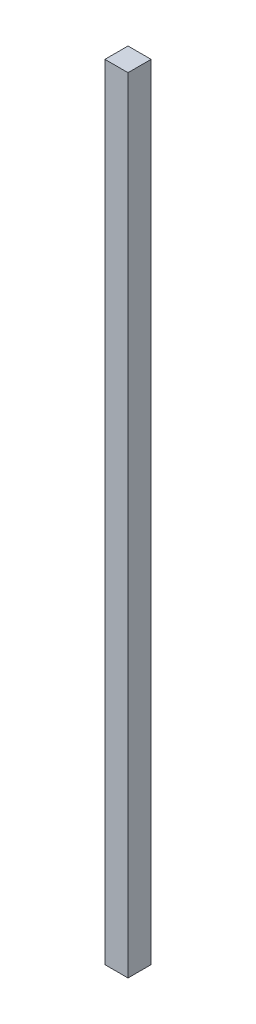
ISO-10303-21;
HEADER;
FILE_DESCRIPTION(('STEP AP214'),'2;1');
FILE_NAME('part.step','',(''),(''),'','','');
FILE_SCHEMA(('AUTOMOTIVE_DESIGN { 1 0 10303 214 1 1 1 1 }'));
ENDSEC;
DATA;
#1=APPLICATION_CONTEXT('core data for automotive mechanical design processes');
#2=APPLICATION_PROTOCOL_DEFINITION('international standard','automotive_design',2000,#1);
#3=PRODUCT_CONTEXT('',#1,'mechanical');
#4=PRODUCT('Part','Part','',(#3));
#5=PRODUCT_RELATED_PRODUCT_CATEGORY('part','',(#4));
#6=PRODUCT_DEFINITION_FORMATION('','',#4);
#7=PRODUCT_DEFINITION_CONTEXT('part definition',#1,'design');
#8=PRODUCT_DEFINITION('design','',#6,#7);
#9=PRODUCT_DEFINITION_SHAPE('','',#8);
#10=(LENGTH_UNIT() NAMED_UNIT(*) SI_UNIT(.MILLI.,.METRE.));
#11=(NAMED_UNIT(*) PLANE_ANGLE_UNIT() SI_UNIT($,.RADIAN.));
#12=(NAMED_UNIT(*) SI_UNIT($,.STERADIAN.) SOLID_ANGLE_UNIT());
#13=UNCERTAINTY_MEASURE_WITH_UNIT(LENGTH_MEASURE(1.E-05),#10,'distance_accuracy_value','');
#14=(GEOMETRIC_REPRESENTATION_CONTEXT(3) GLOBAL_UNCERTAINTY_ASSIGNED_CONTEXT((#13)) GLOBAL_UNIT_ASSIGNED_CONTEXT((#10,
#11,#12)) REPRESENTATION_CONTEXT('',''));
#15=CARTESIAN_POINT('',(0.,0.,0.));
#16=DIRECTION('',(0.,0.,1.));
#17=DIRECTION('',(1.,0.,0.));
#18=AXIS2_PLACEMENT_3D('',#15,#16,#17);
#19=CARTESIAN_POINT('',(0.,647.,0.));
#20=DIRECTION('',(1.,0.,0.));
#21=DIRECTION('',(0.,0.,-1.));
#22=AXIS2_PLACEMENT_3D('',#19,#20,#21);
#23=PLANE('',#22);
#24=DIRECTION('',(0.,0.,1.));
#25=VECTOR('',#24,1.);
#26=CARTESIAN_POINT('',(0.,0.,0.));
#27=LINE('',#26,#25);
#28=CARTESIAN_POINT('',(0.,0.,0.));
#29=VERTEX_POINT('',#28);
#30=CARTESIAN_POINT('',(0.,0.,19.05));
#31=VERTEX_POINT('',#30);
#32=EDGE_CURVE('E96',#29,#31,#27,.T.);
#33=ORIENTED_EDGE('',*,*,#32,.T.);
#34=DIRECTION('',(0.,-1.,0.));
#35=VECTOR('',#34,1.);
#36=CARTESIAN_POINT('',(0.,647.,19.05));
#37=LINE('',#36,#35);
#38=CARTESIAN_POINT('',(0.,647.,19.05));
#39=VERTEX_POINT('',#38);
#40=EDGE_CURVE('E11',#39,#31,#37,.T.);
#41=ORIENTED_EDGE('',*,*,#40,.F.);
#42=DIRECTION('',(0.,0.,1.));
#43=VECTOR('',#42,1.);
#44=CARTESIAN_POINT('',(0.,647.,0.));
#45=LINE('',#44,#43);
#46=CARTESIAN_POINT('',(0.,647.,0.));
#47=VERTEX_POINT('',#46);
#48=EDGE_CURVE('E84',#47,#39,#45,.T.);
#49=ORIENTED_EDGE('',*,*,#48,.F.);
#50=DIRECTION('',(0.,-1.,0.));
#51=VECTOR('',#50,1.);
#52=CARTESIAN_POINT('',(0.,647.,0.));
#53=LINE('',#52,#51);
#54=EDGE_CURVE('E92',#47,#29,#53,.T.);
#55=ORIENTED_EDGE('',*,*,#54,.T.);
#56=EDGE_LOOP('',(#33,#41,#49,#55));
#57=FACE_BOUND('',#56,.T.);
#58=ADVANCED_FACE('F33',(#57),#23,.F.);
#59=CARTESIAN_POINT('',(0.,647.,19.05));
#60=DIRECTION('',(0.,0.,-1.));
#61=DIRECTION('',(-1.,0.,0.));
#62=AXIS2_PLACEMENT_3D('',#59,#60,#61);
#63=PLANE('',#62);
#64=DIRECTION('',(1.,0.,0.));
#65=VECTOR('',#64,1.);
#66=CARTESIAN_POINT('',(0.,0.,19.05));
#67=LINE('',#66,#65);
#68=CARTESIAN_POINT('',(19.05,0.,19.05));
#69=VERTEX_POINT('',#68);
#70=EDGE_CURVE('E88',#31,#69,#67,.T.);
#71=ORIENTED_EDGE('',*,*,#70,.T.);
#72=DIRECTION('',(0.,-1.,0.));
#73=VECTOR('',#72,1.);
#74=CARTESIAN_POINT('',(19.05,647.,19.05));
#75=LINE('',#74,#73);
#76=CARTESIAN_POINT('',(19.05,647.,19.05));
#77=VERTEX_POINT('',#76);
#78=EDGE_CURVE('E41',#77,#69,#75,.T.);
#79=ORIENTED_EDGE('',*,*,#78,.F.);
#80=DIRECTION('',(1.,0.,0.));
#81=VECTOR('',#80,1.);
#82=CARTESIAN_POINT('',(0.,647.,19.05));
#83=LINE('',#82,#81);
#84=EDGE_CURVE('E79',#39,#77,#83,.T.);
#85=ORIENTED_EDGE('',*,*,#84,.F.);
#86=ORIENTED_EDGE('',*,*,#40,.T.);
#87=EDGE_LOOP('',(#71,#79,#85,#86));
#88=FACE_BOUND('',#87,.T.);
#89=ADVANCED_FACE('F87',(#88),#63,.F.);
#90=CARTESIAN_POINT('',(19.05,647.,0.));
#91=DIRECTION('',(-1.,0.,0.));
#92=DIRECTION('',(0.,0.,1.));
#93=AXIS2_PLACEMENT_3D('',#90,#91,#92);
#94=PLANE('',#93);
#95=DIRECTION('',(0.,0.,-1.));
#96=VECTOR('',#95,1.);
#97=CARTESIAN_POINT('',(19.05,0.,0.));
#98=LINE('',#97,#96);
#99=CARTESIAN_POINT('',(19.05,0.,0.));
#100=VERTEX_POINT('',#99);
#101=EDGE_CURVE('E66',#69,#100,#98,.T.);
#102=ORIENTED_EDGE('',*,*,#101,.T.);
#103=DIRECTION('',(0.,-1.,0.));
#104=VECTOR('',#103,1.);
#105=CARTESIAN_POINT('',(19.05,647.,0.));
#106=LINE('',#105,#104);
#107=CARTESIAN_POINT('',(19.05,647.,0.));
#108=VERTEX_POINT('',#107);
#109=EDGE_CURVE('E89',#108,#100,#106,.T.);
#110=ORIENTED_EDGE('',*,*,#109,.F.);
#111=DIRECTION('',(0.,0.,-1.));
#112=VECTOR('',#111,1.);
#113=CARTESIAN_POINT('',(19.05,647.,0.));
#114=LINE('',#113,#112);
#115=EDGE_CURVE('E82',#77,#108,#114,.T.);
#116=ORIENTED_EDGE('',*,*,#115,.F.);
#117=ORIENTED_EDGE('',*,*,#78,.T.);
#118=EDGE_LOOP('',(#102,#110,#116,#117));
#119=FACE_BOUND('',#118,.T.);
#120=ADVANCED_FACE('F90',(#119),#94,.F.);
#121=CARTESIAN_POINT('',(0.,647.,0.));
#122=DIRECTION('',(0.,0.,1.));
#123=DIRECTION('',(1.,0.,0.));
#124=AXIS2_PLACEMENT_3D('',#121,#122,#123);
#125=PLANE('',#124);
#126=DIRECTION('',(-1.,0.,0.));
#127=VECTOR('',#126,1.);
#128=CARTESIAN_POINT('',(0.,0.,0.));
#129=LINE('',#128,#127);
#130=EDGE_CURVE('E72',#100,#29,#129,.T.);
#131=ORIENTED_EDGE('',*,*,#130,.T.);
#132=ORIENTED_EDGE('',*,*,#54,.F.);
#133=DIRECTION('',(-1.,0.,0.));
#134=VECTOR('',#133,1.);
#135=CARTESIAN_POINT('',(0.,647.,0.));
#136=LINE('',#135,#134);
#137=EDGE_CURVE('E49',#108,#47,#136,.T.);
#138=ORIENTED_EDGE('',*,*,#137,.F.);
#139=ORIENTED_EDGE('',*,*,#109,.T.);
#140=EDGE_LOOP('',(#131,#132,#138,#139));
#141=FACE_BOUND('',#140,.T.);
#142=ADVANCED_FACE('F103',(#141),#125,.F.);
#143=CARTESIAN_POINT('',(0.,647.,0.));
#144=DIRECTION('',(0.,1.,0.));
#145=DIRECTION('',(0.,0.,1.));
#146=AXIS2_PLACEMENT_3D('',#143,#144,#145);
#147=PLANE('',#146);
#148=ORIENTED_EDGE('',*,*,#48,.T.);
#149=ORIENTED_EDGE('',*,*,#84,.T.);
#150=ORIENTED_EDGE('',*,*,#115,.T.);
#151=ORIENTED_EDGE('',*,*,#137,.T.);
#152=EDGE_LOOP('',(#148,#149,#150,#151));
#153=FACE_BOUND('',#152,.T.);
#154=ADVANCED_FACE('F80',(#153),#147,.T.);
#155=CARTESIAN_POINT('',(0.,0.,0.));
#156=DIRECTION('',(0.,1.,0.));
#157=DIRECTION('',(0.,0.,1.));
#158=AXIS2_PLACEMENT_3D('',#155,#156,#157);
#159=PLANE('',#158);
#160=ORIENTED_EDGE('',*,*,#32,.F.);
#161=ORIENTED_EDGE('',*,*,#130,.F.);
#162=ORIENTED_EDGE('',*,*,#101,.F.);
#163=ORIENTED_EDGE('',*,*,#70,.F.);
#164=EDGE_LOOP('',(#160,#161,#162,#163));
#165=FACE_BOUND('',#164,.T.);
#166=ADVANCED_FACE('F106',(#165),#159,.F.);
#167=CLOSED_SHELL('',(#58,#89,#120,#142,#154,#166));
#168=MANIFOLD_SOLID_BREP('B2',#167);
#169=ADVANCED_BREP_SHAPE_REPRESENTATION('',(#18,#168),#14);
#170=SHAPE_DEFINITION_REPRESENTATION(#9,#169);
ENDSEC;
END-ISO-10303-21;
